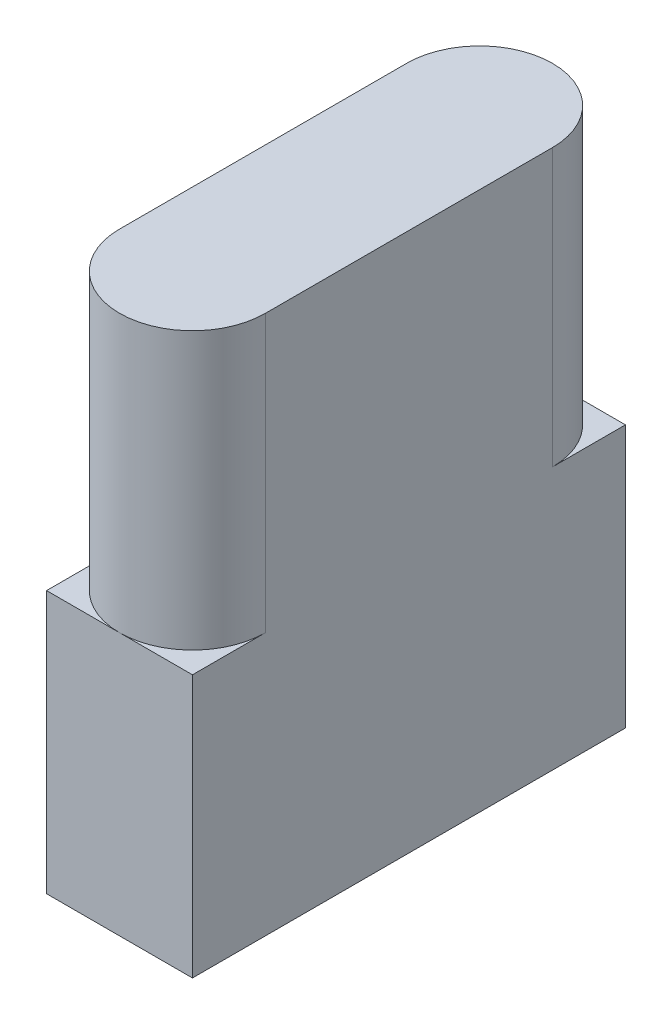
ISO-10303-21;
HEADER;
FILE_DESCRIPTION(('STEP AP214'),'2;1');
FILE_NAME('part.step','',(''),(''),'','','');
FILE_SCHEMA(('AUTOMOTIVE_DESIGN { 1 0 10303 214 1 1 1 1 }'));
ENDSEC;
DATA;
#1=APPLICATION_CONTEXT('core data for automotive mechanical design processes');
#2=APPLICATION_PROTOCOL_DEFINITION('international standard','automotive_design',2000,#1);
#3=PRODUCT_CONTEXT('',#1,'mechanical');
#4=PRODUCT('Part','Part','',(#3));
#5=PRODUCT_RELATED_PRODUCT_CATEGORY('part','',(#4));
#6=PRODUCT_DEFINITION_FORMATION('','',#4);
#7=PRODUCT_DEFINITION_CONTEXT('part definition',#1,'design');
#8=PRODUCT_DEFINITION('design','',#6,#7);
#9=PRODUCT_DEFINITION_SHAPE('','',#8);
#10=(LENGTH_UNIT() NAMED_UNIT(*) SI_UNIT(.MILLI.,.METRE.));
#11=(NAMED_UNIT(*) PLANE_ANGLE_UNIT() SI_UNIT($,.RADIAN.));
#12=(NAMED_UNIT(*) SI_UNIT($,.STERADIAN.) SOLID_ANGLE_UNIT());
#13=UNCERTAINTY_MEASURE_WITH_UNIT(LENGTH_MEASURE(1.E-05),#10,'distance_accuracy_value','');
#14=(GEOMETRIC_REPRESENTATION_CONTEXT(3) GLOBAL_UNCERTAINTY_ASSIGNED_CONTEXT((#13)) GLOBAL_UNIT_ASSIGNED_CONTEXT((#10,
#11,#12)) REPRESENTATION_CONTEXT('',''));
#15=CARTESIAN_POINT('',(0.,0.,0.));
#16=DIRECTION('',(0.,0.,1.));
#17=DIRECTION('',(1.,0.,0.));
#18=AXIS2_PLACEMENT_3D('',#15,#16,#17);
#19=CARTESIAN_POINT('',(0.,10.5000000405586,0.));
#20=DIRECTION('',(0.,1.,0.));
#21=DIRECTION('',(1.,0.,0.));
#22=AXIS2_PLACEMENT_3D('',#19,#20,#21);
#23=PLANE('',#22);
#24=CARTESIAN_POINT('',(23.5837659994613,10.5000000405586,48.7440656521431));
#25=DIRECTION('',(0.,-1.,0.));
#26=DIRECTION('',(-1.,0.,0.));
#27=AXIS2_PLACEMENT_3D('',#24,#25,#26);
#28=CIRCLE('',#27,2.5);
#29=CARTESIAN_POINT('',(23.5837659994613,10.5000000405586,51.2440656521431));
#30=VERTEX_POINT('',#29);
#31=CARTESIAN_POINT('',(21.0837659994613,10.5000000405586,48.7440656521431));
#32=VERTEX_POINT('',#31);
#33=EDGE_CURVE('E156',#30,#32,#28,.T.);
#34=ORIENTED_EDGE('',*,*,#33,.T.);
#35=DIRECTION('',(0.,0.,1.));
#36=VECTOR('',#35,1.);
#37=CARTESIAN_POINT('',(21.0837659994613,10.5000000405586,51.2440656521431));
#38=LINE('',#37,#36);
#39=CARTESIAN_POINT('',(21.0837659994613,10.5000000405586,51.2440656521431));
#40=VERTEX_POINT('',#39);
#41=EDGE_CURVE('E26',#32,#40,#38,.T.);
#42=ORIENTED_EDGE('',*,*,#41,.T.);
#43=DIRECTION('',(1.,0.,0.));
#44=VECTOR('',#43,1.);
#45=CARTESIAN_POINT('',(26.0837659994613,10.5000000405586,51.2440656521431));
#46=LINE('',#45,#44);
#47=EDGE_CURVE('E160',#40,#30,#46,.T.);
#48=ORIENTED_EDGE('',*,*,#47,.T.);
#49=EDGE_LOOP('',(#34,#42,#48));
#50=FACE_BOUND('',#49,.T.);
#51=ADVANCED_FACE('F16',(#50),#23,.T.);
#52=CARTESIAN_POINT('',(26.0837659994613,1.50000004055861,36.4040656521431));
#53=DIRECTION('',(0.,0.,-1.));
#54=DIRECTION('',(0.,-1.,0.));
#55=AXIS2_PLACEMENT_3D('',#52,#53,#54);
#56=PLANE('',#55);
#57=DIRECTION('',(1.,0.,0.));
#58=VECTOR('',#57,1.);
#59=CARTESIAN_POINT('',(13.0418829997307,1.5,36.4040656521431));
#60=LINE('',#59,#58);
#61=CARTESIAN_POINT('',(21.0837659994613,1.50000004055861,36.4040656521431));
#62=VERTEX_POINT('',#61);
#63=CARTESIAN_POINT('',(26.0837659994613,1.50000004055861,36.4040656521431));
#64=VERTEX_POINT('',#63);
#65=EDGE_CURVE('E141',#62,#64,#60,.T.);
#66=ORIENTED_EDGE('',*,*,#65,.F.);
#67=DIRECTION('',(0.,1.,0.));
#68=VECTOR('',#67,1.);
#69=CARTESIAN_POINT('',(21.0837659994613,1.50000004055861,36.4040656521431));
#70=LINE('',#69,#68);
#71=CARTESIAN_POINT('',(21.0837659994613,10.5000000405586,36.4040656521431));
#72=VERTEX_POINT('',#71);
#73=EDGE_CURVE('E11',#62,#72,#70,.T.);
#74=ORIENTED_EDGE('',*,*,#73,.T.);
#75=DIRECTION('',(-1.,0.,0.));
#76=VECTOR('',#75,1.);
#77=CARTESIAN_POINT('',(21.0837659994613,10.5000000405586,36.4040656521431));
#78=LINE('',#77,#76);
#79=CARTESIAN_POINT('',(23.5837659994613,10.5000000405586,36.4040656521431));
#80=VERTEX_POINT('',#79);
#81=EDGE_CURVE('E112',#80,#72,#78,.T.);
#82=ORIENTED_EDGE('',*,*,#81,.F.);
#83=DIRECTION('',(-1.,0.,0.));
#84=VECTOR('',#83,1.);
#85=CARTESIAN_POINT('',(21.0837659994613,10.5000000405586,36.4040656521431));
#86=LINE('',#85,#84);
#87=CARTESIAN_POINT('',(26.0837659994613,10.5000000405586,36.4040656521431));
#88=VERTEX_POINT('',#87);
#89=EDGE_CURVE('E172',#88,#80,#86,.T.);
#90=ORIENTED_EDGE('',*,*,#89,.F.);
#91=DIRECTION('',(0.,1.,0.));
#92=VECTOR('',#91,1.);
#93=CARTESIAN_POINT('',(26.0837659994613,1.50000004055861,36.4040656521431));
#94=LINE('',#93,#92);
#95=EDGE_CURVE('E96',#64,#88,#94,.T.);
#96=ORIENTED_EDGE('',*,*,#95,.F.);
#97=EDGE_LOOP('',(#66,#74,#82,#90,#96));
#98=FACE_BOUND('',#97,.T.);
#99=ADVANCED_FACE('F273',(#98),#56,.T.);
#100=CARTESIAN_POINT('',(21.0837659994613,1.50000004055861,36.4040656521431));
#101=DIRECTION('',(-1.,0.,0.));
#102=DIRECTION('',(0.,0.,1.));
#103=AXIS2_PLACEMENT_3D('',#100,#101,#102);
#104=PLANE('',#103);
#105=DIRECTION('',(0.,0.,-1.));
#106=VECTOR('',#105,1.);
#107=CARTESIAN_POINT('',(21.0837659994613,1.5,18.2020328260715));
#108=LINE('',#107,#106);
#109=CARTESIAN_POINT('',(21.0837659994613,1.50000004055861,51.2440656521431));
#110=VERTEX_POINT('',#109);
#111=EDGE_CURVE('E145',#110,#62,#108,.T.);
#112=ORIENTED_EDGE('',*,*,#111,.F.);
#113=DIRECTION('',(0.,1.,0.));
#114=VECTOR('',#113,1.);
#115=CARTESIAN_POINT('',(21.0837659994613,1.50000004055861,51.2440656521431));
#116=LINE('',#115,#114);
#117=EDGE_CURVE('E166',#110,#40,#116,.T.);
#118=ORIENTED_EDGE('',*,*,#117,.T.);
#119=ORIENTED_EDGE('',*,*,#41,.F.);
#120=DIRECTION('',(0.,1.,0.));
#121=VECTOR('',#120,1.);
#122=CARTESIAN_POINT('',(21.0837659994613,10.5000000405586,48.7440656521431));
#123=LINE('',#122,#121);
#124=CARTESIAN_POINT('',(21.0837659994613,19.9800000405586,48.7440656521431));
#125=VERTEX_POINT('',#124);
#126=EDGE_CURVE('E19',#32,#125,#123,.T.);
#127=ORIENTED_EDGE('',*,*,#126,.T.);
#128=DIRECTION('',(0.,0.,1.));
#129=VECTOR('',#128,1.);
#130=CARTESIAN_POINT('',(21.0837659994613,19.9800000405586,38.9040656521431));
#131=LINE('',#130,#129);
#132=CARTESIAN_POINT('',(21.0837659994613,19.9800000405586,38.9040656521431));
#133=VERTEX_POINT('',#132);
#134=EDGE_CURVE('E120',#133,#125,#131,.T.);
#135=ORIENTED_EDGE('',*,*,#134,.F.);
#136=DIRECTION('',(0.,1.,0.));
#137=VECTOR('',#136,1.);
#138=CARTESIAN_POINT('',(21.0837659994613,10.5000000405586,38.9040656521431));
#139=LINE('',#138,#137);
#140=CARTESIAN_POINT('',(21.0837659994613,10.5000000405586,38.9040656521431));
#141=VERTEX_POINT('',#140);
#142=EDGE_CURVE('E116',#141,#133,#139,.T.);
#143=ORIENTED_EDGE('',*,*,#142,.F.);
#144=DIRECTION('',(0.,0.,1.));
#145=VECTOR('',#144,1.);
#146=CARTESIAN_POINT('',(21.0837659994613,10.5000000405586,51.2440656521431));
#147=LINE('',#146,#145);
#148=EDGE_CURVE('E105',#72,#141,#147,.T.);
#149=ORIENTED_EDGE('',*,*,#148,.F.);
#150=ORIENTED_EDGE('',*,*,#73,.F.);
#151=EDGE_LOOP('',(#112,#118,#119,#127,#135,#143,#149,#150));
#152=FACE_BOUND('',#151,.T.);
#153=ADVANCED_FACE('F117',(#152),#104,.T.);
#154=CARTESIAN_POINT('',(21.0837659994613,1.50000004055861,51.2440656521431));
#155=DIRECTION('',(0.,0.,1.));
#156=DIRECTION('',(1.,0.,0.));
#157=AXIS2_PLACEMENT_3D('',#154,#155,#156);
#158=PLANE('',#157);
#159=DIRECTION('',(-1.,0.,0.));
#160=VECTOR('',#159,1.);
#161=CARTESIAN_POINT('',(10.5418829997307,1.5,51.2440656521431));
#162=LINE('',#161,#160);
#163=CARTESIAN_POINT('',(26.0837659994613,1.50000004055861,51.2440656521431));
#164=VERTEX_POINT('',#163);
#165=EDGE_CURVE('E171',#164,#110,#162,.T.);
#166=ORIENTED_EDGE('',*,*,#165,.F.);
#167=DIRECTION('',(0.,1.,0.));
#168=VECTOR('',#167,1.);
#169=CARTESIAN_POINT('',(26.0837659994613,1.50000004055861,51.2440656521431));
#170=LINE('',#169,#168);
#171=CARTESIAN_POINT('',(26.0837659994613,10.5000000405586,51.2440656521431));
#172=VERTEX_POINT('',#171);
#173=EDGE_CURVE('E157',#164,#172,#170,.T.);
#174=ORIENTED_EDGE('',*,*,#173,.T.);
#175=DIRECTION('',(1.,0.,0.));
#176=VECTOR('',#175,1.);
#177=CARTESIAN_POINT('',(26.0837659994613,10.5000000405586,51.2440656521431));
#178=LINE('',#177,#176);
#179=EDGE_CURVE('E150',#30,#172,#178,.T.);
#180=ORIENTED_EDGE('',*,*,#179,.F.);
#181=ORIENTED_EDGE('',*,*,#47,.F.);
#182=ORIENTED_EDGE('',*,*,#117,.F.);
#183=EDGE_LOOP('',(#166,#174,#180,#181,#182));
#184=FACE_BOUND('',#183,.T.);
#185=ADVANCED_FACE('F195',(#184),#158,.T.);
#186=CARTESIAN_POINT('',(26.0837659994613,1.50000004055861,51.2440656521431));
#187=DIRECTION('',(1.,0.,0.));
#188=DIRECTION('',(0.,1.,0.));
#189=AXIS2_PLACEMENT_3D('',#186,#187,#188);
#190=PLANE('',#189);
#191=DIRECTION('',(0.,0.,1.));
#192=VECTOR('',#191,1.);
#193=CARTESIAN_POINT('',(26.0837659994613,1.5,25.6220328260715));
#194=LINE('',#193,#192);
#195=EDGE_CURVE('E144',#64,#164,#194,.T.);
#196=ORIENTED_EDGE('',*,*,#195,.F.);
#197=ORIENTED_EDGE('',*,*,#95,.T.);
#198=DIRECTION('',(0.,0.,-1.));
#199=VECTOR('',#198,1.);
#200=CARTESIAN_POINT('',(26.0837659994613,10.5000000405586,36.4040656521431));
#201=LINE('',#200,#199);
#202=CARTESIAN_POINT('',(26.0837659994613,10.5000000405586,38.9040656521431));
#203=VERTEX_POINT('',#202);
#204=EDGE_CURVE('E176',#203,#88,#201,.T.);
#205=ORIENTED_EDGE('',*,*,#204,.F.);
#206=DIRECTION('',(0.,1.,0.));
#207=VECTOR('',#206,1.);
#208=CARTESIAN_POINT('',(26.0837659994613,10.5000000405586,38.9040656521431));
#209=LINE('',#208,#207);
#210=CARTESIAN_POINT('',(26.0837659994613,19.9800000405586,38.9040656521431));
#211=VERTEX_POINT('',#210);
#212=EDGE_CURVE('E340',#203,#211,#209,.T.);
#213=ORIENTED_EDGE('',*,*,#212,.T.);
#214=DIRECTION('',(0.,0.,-1.));
#215=VECTOR('',#214,1.);
#216=CARTESIAN_POINT('',(26.0837659994613,19.9800000405586,48.7440656521431));
#217=LINE('',#216,#215);
#218=CARTESIAN_POINT('',(26.0837659994613,19.9800000405586,48.7440656521431));
#219=VERTEX_POINT('',#218);
#220=EDGE_CURVE('E329',#219,#211,#217,.T.);
#221=ORIENTED_EDGE('',*,*,#220,.F.);
#222=DIRECTION('',(0.,1.,0.));
#223=VECTOR('',#222,1.);
#224=CARTESIAN_POINT('',(26.0837659994613,10.5000000405586,48.7440656521431));
#225=LINE('',#224,#223);
#226=CARTESIAN_POINT('',(26.0837659994613,10.5000000405586,48.7440656521431));
#227=VERTEX_POINT('',#226);
#228=EDGE_CURVE('E155',#227,#219,#225,.T.);
#229=ORIENTED_EDGE('',*,*,#228,.F.);
#230=DIRECTION('',(0.,0.,-1.));
#231=VECTOR('',#230,1.);
#232=CARTESIAN_POINT('',(26.0837659994613,10.5000000405586,36.4040656521431));
#233=LINE('',#232,#231);
#234=EDGE_CURVE('E146',#172,#227,#233,.T.);
#235=ORIENTED_EDGE('',*,*,#234,.F.);
#236=ORIENTED_EDGE('',*,*,#173,.F.);
#237=EDGE_LOOP('',(#196,#197,#205,#213,#221,#229,#235,#236));
#238=FACE_BOUND('',#237,.T.);
#239=ADVANCED_FACE('F254',(#238),#190,.T.);
#240=CARTESIAN_POINT('',(0.,10.5000000405586,0.));
#241=DIRECTION('',(0.,1.,0.));
#242=DIRECTION('',(1.,0.,0.));
#243=AXIS2_PLACEMENT_3D('',#240,#241,#242);
#244=PLANE('',#243);
#245=CARTESIAN_POINT('',(23.5837659994613,10.5000000405586,38.9040656521431));
#246=DIRECTION('',(0.,-1.,0.));
#247=DIRECTION('',(1.,0.,0.));
#248=AXIS2_PLACEMENT_3D('',#245,#246,#247);
#249=CIRCLE('',#248,2.5);
#250=EDGE_CURVE('E109',#141,#80,#249,.T.);
#251=ORIENTED_EDGE('',*,*,#250,.T.);
#252=ORIENTED_EDGE('',*,*,#81,.T.);
#253=ORIENTED_EDGE('',*,*,#148,.T.);
#254=EDGE_LOOP('',(#251,#252,#253));
#255=FACE_BOUND('',#254,.T.);
#256=ADVANCED_FACE('F107',(#255),#244,.T.);
#257=CARTESIAN_POINT('',(0.,10.5000000405586,0.));
#258=DIRECTION('',(0.,1.,0.));
#259=DIRECTION('',(1.,0.,0.));
#260=AXIS2_PLACEMENT_3D('',#257,#258,#259);
#261=PLANE('',#260);
#262=CARTESIAN_POINT('',(23.5837659994613,10.5000000405586,48.7440656521431));
#263=DIRECTION('',(0.,-1.,0.));
#264=DIRECTION('',(-1.,0.,0.));
#265=AXIS2_PLACEMENT_3D('',#262,#263,#264);
#266=CIRCLE('',#265,2.5);
#267=EDGE_CURVE('E151',#227,#30,#266,.T.);
#268=ORIENTED_EDGE('',*,*,#267,.T.);
#269=ORIENTED_EDGE('',*,*,#179,.T.);
#270=ORIENTED_EDGE('',*,*,#234,.T.);
#271=EDGE_LOOP('',(#268,#269,#270));
#272=FACE_BOUND('',#271,.T.);
#273=ADVANCED_FACE('F201',(#272),#261,.T.);
#274=CARTESIAN_POINT('',(0.,10.5000000405586,0.));
#275=DIRECTION('',(0.,1.,0.));
#276=DIRECTION('',(1.,0.,0.));
#277=AXIS2_PLACEMENT_3D('',#274,#275,#276);
#278=PLANE('',#277);
#279=CARTESIAN_POINT('',(23.5837659994613,10.5000000405586,38.9040656521431));
#280=DIRECTION('',(0.,-1.,0.));
#281=DIRECTION('',(1.,0.,0.));
#282=AXIS2_PLACEMENT_3D('',#279,#280,#281);
#283=CIRCLE('',#282,2.5);
#284=EDGE_CURVE('E130',#80,#203,#283,.T.);
#285=ORIENTED_EDGE('',*,*,#284,.T.);
#286=ORIENTED_EDGE('',*,*,#204,.T.);
#287=ORIENTED_EDGE('',*,*,#89,.T.);
#288=EDGE_LOOP('',(#285,#286,#287));
#289=FACE_BOUND('',#288,.T.);
#290=ADVANCED_FACE('F216',(#289),#278,.T.);
#291=CARTESIAN_POINT('',(23.5837659994613,19.9800000811172,43.8240656521431));
#292=DIRECTION('',(0.,1.,0.));
#293=DIRECTION('',(1.,0.,0.));
#294=AXIS2_PLACEMENT_3D('',#291,#292,#293);
#295=PLANE('',#294);
#296=CARTESIAN_POINT('',(23.5837659994613,19.9800000405586,38.9040656521431));
#297=DIRECTION('',(0.,1.,0.));
#298=DIRECTION('',(1.,0.,0.));
#299=AXIS2_PLACEMENT_3D('',#296,#297,#298);
#300=CIRCLE('',#299,2.5);
#301=EDGE_CURVE('E125',#211,#133,#300,.T.);
#302=ORIENTED_EDGE('',*,*,#301,.T.);
#303=ORIENTED_EDGE('',*,*,#134,.T.);
#304=CARTESIAN_POINT('',(23.5837659994613,19.9800000405586,48.7440656521431));
#305=DIRECTION('',(0.,1.,0.));
#306=DIRECTION('',(-1.,0.,0.));
#307=AXIS2_PLACEMENT_3D('',#304,#305,#306);
#308=CIRCLE('',#307,2.5);
#309=EDGE_CURVE('E162',#125,#219,#308,.T.);
#310=ORIENTED_EDGE('',*,*,#309,.T.);
#311=ORIENTED_EDGE('',*,*,#220,.T.);
#312=EDGE_LOOP('',(#302,#303,#310,#311));
#313=FACE_BOUND('',#312,.T.);
#314=ADVANCED_FACE('F211',(#313),#295,.T.);
#315=CARTESIAN_POINT('',(23.5837659994613,10.5000000405586,38.9040656521431));
#316=DIRECTION('',(0.,1.,0.));
#317=DIRECTION('',(1.,0.,0.));
#318=AXIS2_PLACEMENT_3D('',#315,#316,#317);
#319=CYLINDRICAL_SURFACE('',#318,2.5);
#320=ORIENTED_EDGE('',*,*,#284,.F.);
#321=ORIENTED_EDGE('',*,*,#250,.F.);
#322=ORIENTED_EDGE('',*,*,#142,.T.);
#323=ORIENTED_EDGE('',*,*,#301,.F.);
#324=ORIENTED_EDGE('',*,*,#212,.F.);
#325=EDGE_LOOP('',(#320,#321,#322,#323,#324));
#326=FACE_BOUND('',#325,.T.);
#327=ADVANCED_FACE('F127',(#326),#319,.T.);
#328=CARTESIAN_POINT('',(23.5837659994613,10.5000000405586,48.7440656521431));
#329=DIRECTION('',(0.,1.,0.));
#330=DIRECTION('',(-1.,0.,0.));
#331=AXIS2_PLACEMENT_3D('',#328,#329,#330);
#332=CYLINDRICAL_SURFACE('',#331,2.5);
#333=ORIENTED_EDGE('',*,*,#33,.F.);
#334=ORIENTED_EDGE('',*,*,#267,.F.);
#335=ORIENTED_EDGE('',*,*,#228,.T.);
#336=ORIENTED_EDGE('',*,*,#309,.F.);
#337=ORIENTED_EDGE('',*,*,#126,.F.);
#338=EDGE_LOOP('',(#333,#334,#335,#336,#337));
#339=FACE_BOUND('',#338,.T.);
#340=ADVANCED_FACE('F205',(#339),#332,.T.);
#341=CARTESIAN_POINT('',(-0.14892918312297,1.49999995944139,0.));
#342=DIRECTION('',(0.,-1.,0.));
#343=DIRECTION('',(0.,0.,-1.));
#344=AXIS2_PLACEMENT_3D('',#341,#342,#343);
#345=PLANE('',#344);
#346=ORIENTED_EDGE('',*,*,#111,.T.);
#347=ORIENTED_EDGE('',*,*,#65,.T.);
#348=ORIENTED_EDGE('',*,*,#195,.T.);
#349=ORIENTED_EDGE('',*,*,#165,.T.);
#350=EDGE_LOOP('',(#346,#347,#348,#349));
#351=FACE_BOUND('',#350,.T.);
#352=ADVANCED_FACE('F225',(#351),#345,.T.);
#353=CLOSED_SHELL('',(#51,#99,#153,#185,#239,#256,#273,#290,#314,#327,#340,#352));
#354=MANIFOLD_SOLID_BREP('B1',#353);
#355=ADVANCED_BREP_SHAPE_REPRESENTATION('',(#18,#354),#14);
#356=SHAPE_DEFINITION_REPRESENTATION(#9,#355);
ENDSEC;
END-ISO-10303-21;
